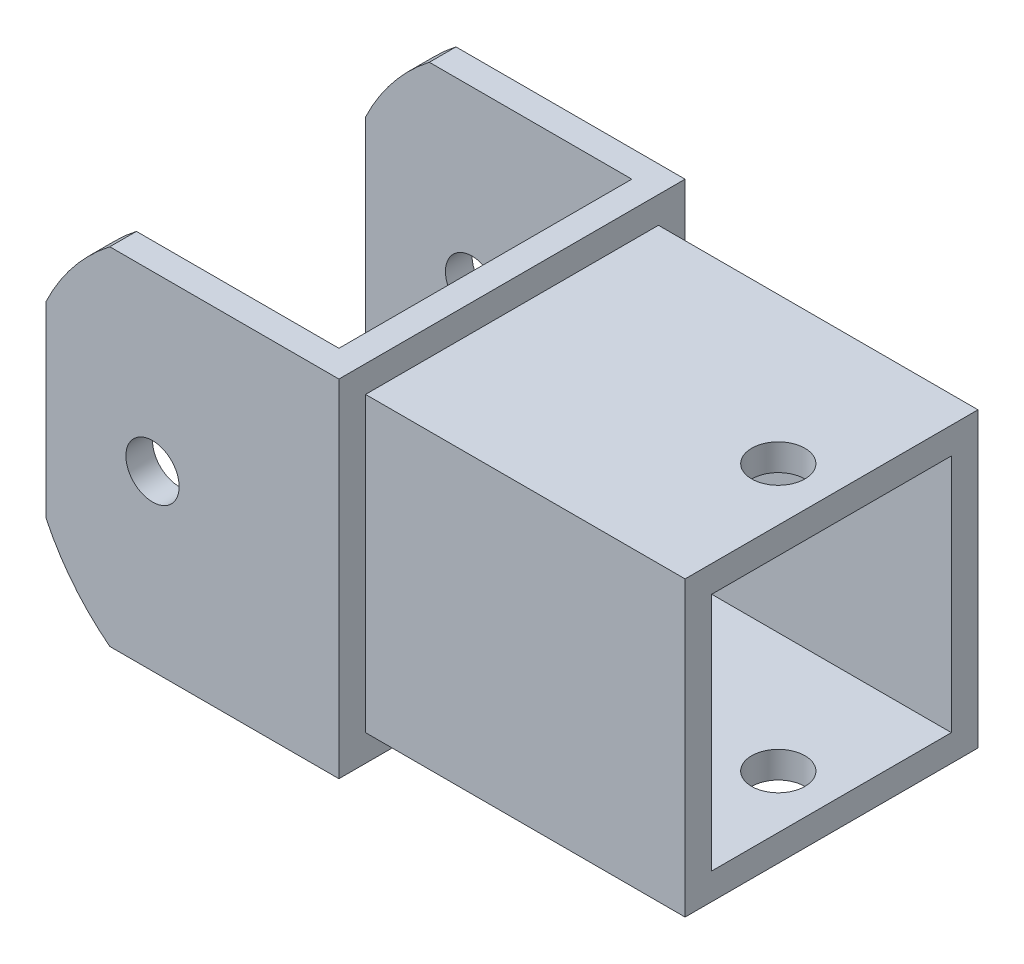
ISO-10303-21;
HEADER;
FILE_DESCRIPTION(('STEP AP214'),'2;1');
FILE_NAME('part.step','',(''),(''),'','','');
FILE_SCHEMA(('AUTOMOTIVE_DESIGN { 1 0 10303 214 1 1 1 1 }'));
ENDSEC;
DATA;
#1=APPLICATION_CONTEXT('core data for automotive mechanical design processes');
#2=APPLICATION_PROTOCOL_DEFINITION('international standard','automotive_design',2000,#1);
#3=PRODUCT_CONTEXT('',#1,'mechanical');
#4=PRODUCT('Part','Part','',(#3));
#5=PRODUCT_RELATED_PRODUCT_CATEGORY('part','',(#4));
#6=PRODUCT_DEFINITION_FORMATION('','',#4);
#7=PRODUCT_DEFINITION_CONTEXT('part definition',#1,'design');
#8=PRODUCT_DEFINITION('design','',#6,#7);
#9=PRODUCT_DEFINITION_SHAPE('','',#8);
#10=(LENGTH_UNIT() NAMED_UNIT(*) SI_UNIT(.MILLI.,.METRE.));
#11=(NAMED_UNIT(*) PLANE_ANGLE_UNIT() SI_UNIT($,.RADIAN.));
#12=(NAMED_UNIT(*) SI_UNIT($,.STERADIAN.) SOLID_ANGLE_UNIT());
#13=UNCERTAINTY_MEASURE_WITH_UNIT(LENGTH_MEASURE(1.E-05),#10,'distance_accuracy_value','');
#14=(GEOMETRIC_REPRESENTATION_CONTEXT(3) GLOBAL_UNCERTAINTY_ASSIGNED_CONTEXT((#13)) GLOBAL_UNIT_ASSIGNED_CONTEXT((#10,
#11,#12)) REPRESENTATION_CONTEXT('',''));
#15=CARTESIAN_POINT('',(0.,0.,0.));
#16=DIRECTION('',(0.,0.,1.));
#17=DIRECTION('',(1.,0.,0.));
#18=AXIS2_PLACEMENT_3D('',#15,#16,#17);
#19=CARTESIAN_POINT('',(-50.8,82.5500000000003,-50.8000000000003));
#20=DIRECTION('',(1.,0.,0.));
#21=DIRECTION('',(0.,0.,-1.));
#22=AXIS2_PLACEMENT_3D('',#19,#20,#21);
#23=PLANE('',#22);
#24=DIRECTION('',(0.,0.,1.));
#25=VECTOR('',#24,1.);
#26=CARTESIAN_POINT('',(-50.8,44.7045580116448,-50.8000000000001));
#27=LINE('',#26,#25);
#28=CARTESIAN_POINT('',(-50.8,44.7045580116448,-50.8000000000003));
#29=VERTEX_POINT('',#28);
#30=CARTESIAN_POINT('',(-50.8,44.7045580116449,-38.1000000000003));
#31=VERTEX_POINT('',#30);
#32=EDGE_CURVE('E239',#29,#31,#27,.T.);
#33=ORIENTED_EDGE('',*,*,#32,.F.);
#34=DIRECTION('',(0.,-1.,0.));
#35=VECTOR('',#34,1.);
#36=CARTESIAN_POINT('',(-50.8,82.5500000000003,-50.8000000000003));
#37=LINE('',#36,#35);
#38=CARTESIAN_POINT('',(-50.8,-44.7045580116442,-50.8000000000003));
#39=VERTEX_POINT('',#38);
#40=EDGE_CURVE('E197',#29,#39,#37,.T.);
#41=ORIENTED_EDGE('',*,*,#40,.T.);
#42=DIRECTION('',(0.,0.,1.));
#43=VECTOR('',#42,1.);
#44=CARTESIAN_POINT('',(-50.8,-44.7045580116442,-50.8000000000001));
#45=LINE('',#44,#43);
#46=CARTESIAN_POINT('',(-50.8,-44.7045580116442,-38.1000000000003));
#47=VERTEX_POINT('',#46);
#48=EDGE_CURVE('E313',#47,#39,#45,.F.);
#49=ORIENTED_EDGE('',*,*,#48,.F.);
#50=DIRECTION('',(0.,-1.,0.));
#51=VECTOR('',#50,1.);
#52=CARTESIAN_POINT('',(-50.8,82.5500000000003,-38.1000000000003));
#53=LINE('',#52,#51);
#54=EDGE_CURVE('E51',#31,#47,#53,.T.);
#55=ORIENTED_EDGE('',*,*,#54,.F.);
#56=EDGE_LOOP('',(#33,#41,#49,#55));
#57=FACE_BOUND('',#56,.T.);
#58=ADVANCED_FACE('F41',(#57),#23,.F.);
#59=CARTESIAN_POINT('',(-50.8,82.5500000000003,-38.1000000000003));
#60=DIRECTION('',(0.,0.,-1.));
#61=DIRECTION('',(-1.,0.,0.));
#62=AXIS2_PLACEMENT_3D('',#59,#60,#61);
#63=PLANE('',#62);
#64=CARTESIAN_POINT('',(0.,3.12250225675825E-13,-38.1000000000003));
#65=DIRECTION('',(0.,0.,-1.));
#66=DIRECTION('',(-1.,0.,0.));
#67=AXIS2_PLACEMENT_3D('',#64,#65,#66);
#68=CIRCLE('',#67,12.7);
#69=CARTESIAN_POINT('',(-12.7,3.12250225675825E-13,-38.1000000000003));
#70=VERTEX_POINT('',#69);
#71=EDGE_CURVE('E341',#70,#70,#68,.T.);
#72=ORIENTED_EDGE('',*,*,#71,.T.);
#73=EDGE_LOOP('',(#72));
#74=FACE_BOUND('',#73,.T.);
#75=CARTESIAN_POINT('',(43.5564957867523,3.12250225675825E-13,-38.1000000000003));
#76=DIRECTION('',(0.,0.,-1.));
#77=DIRECTION('',(-1.,0.,0.));
#78=AXIS2_PLACEMENT_3D('',#75,#76,#77);
#79=CIRCLE('',#78,104.410946764082);
#80=CARTESIAN_POINT('',(-20.3742738329848,82.5500000000003,-38.1000000000003));
#81=VERTEX_POINT('',#80);
#82=EDGE_CURVE('E67',#31,#81,#79,.T.);
#83=ORIENTED_EDGE('',*,*,#82,.F.);
#84=ORIENTED_EDGE('',*,*,#54,.T.);
#85=CARTESIAN_POINT('',(-20.3742738329847,-82.5499999999997,-38.1000000000003));
#86=VERTEX_POINT('',#85);
#87=EDGE_CURVE('E310',#86,#47,#79,.T.);
#88=ORIENTED_EDGE('',*,*,#87,.F.);
#89=DIRECTION('',(1.,0.,0.));
#90=VECTOR('',#89,1.);
#91=CARTESIAN_POINT('',(-50.8,-82.5499999999997,-38.1000000000003));
#92=LINE('',#91,#90);
#93=CARTESIAN_POINT('',(76.2,-82.5499999999997,-38.1000000000003));
#94=VERTEX_POINT('',#93);
#95=EDGE_CURVE('E214',#86,#94,#92,.T.);
#96=ORIENTED_EDGE('',*,*,#95,.T.);
#97=DIRECTION('',(0.,-1.,0.));
#98=VECTOR('',#97,1.);
#99=CARTESIAN_POINT('',(76.2,82.5500000000003,-38.1000000000003));
#100=LINE('',#99,#98);
#101=CARTESIAN_POINT('',(76.2,82.5500000000003,-38.1000000000003));
#102=VERTEX_POINT('',#101);
#103=EDGE_CURVE('E243',#102,#94,#100,.T.);
#104=ORIENTED_EDGE('',*,*,#103,.F.);
#105=DIRECTION('',(1.,0.,0.));
#106=VECTOR('',#105,1.);
#107=CARTESIAN_POINT('',(-50.8,82.5500000000003,-38.1000000000003));
#108=LINE('',#107,#106);
#109=EDGE_CURVE('E267',#81,#102,#108,.T.);
#110=ORIENTED_EDGE('',*,*,#109,.F.);
#111=EDGE_LOOP('',(#83,#84,#88,#96,#104,#110));
#112=FACE_BOUND('',#111,.T.);
#113=ADVANCED_FACE('F457',(#74,#112),#63,.F.);
#114=CARTESIAN_POINT('',(76.2,82.5500000000003,101.6));
#115=DIRECTION('',(0.,0.,1.));
#116=DIRECTION('',(1.,0.,0.));
#117=AXIS2_PLACEMENT_3D('',#114,#115,#116);
#118=PLANE('',#117);
#119=CARTESIAN_POINT('',(0.,3.12250225675825E-13,101.6));
#120=DIRECTION('',(0.,0.,1.));
#121=DIRECTION('',(1.,0.,0.));
#122=AXIS2_PLACEMENT_3D('',#119,#120,#121);
#123=CIRCLE('',#122,12.7);
#124=CARTESIAN_POINT('',(12.7,3.12250225675825E-13,101.6));
#125=VERTEX_POINT('',#124);
#126=EDGE_CURVE('E337',#125,#125,#123,.T.);
#127=ORIENTED_EDGE('',*,*,#126,.T.);
#128=EDGE_LOOP('',(#127));
#129=FACE_BOUND('',#128,.T.);
#130=CARTESIAN_POINT('',(43.5564957867523,3.12250225675825E-13,101.6));
#131=DIRECTION('',(0.,0.,1.));
#132=DIRECTION('',(1.,0.,0.));
#133=AXIS2_PLACEMENT_3D('',#130,#131,#132);
#134=CIRCLE('',#133,104.410946764082);
#135=CARTESIAN_POINT('',(-20.3742738329847,82.5500000000003,101.6));
#136=VERTEX_POINT('',#135);
#137=CARTESIAN_POINT('',(-50.7999999999997,44.7045580116454,101.6));
#138=VERTEX_POINT('',#137);
#139=EDGE_CURVE('E309',#136,#138,#134,.T.);
#140=ORIENTED_EDGE('',*,*,#139,.F.);
#141=DIRECTION('',(-1.,0.,0.));
#142=VECTOR('',#141,1.);
#143=CARTESIAN_POINT('',(76.2,82.5500000000003,101.6));
#144=LINE('',#143,#142);
#145=CARTESIAN_POINT('',(76.2,82.5500000000003,101.6));
#146=VERTEX_POINT('',#145);
#147=EDGE_CURVE('E433',#146,#136,#144,.T.);
#148=ORIENTED_EDGE('',*,*,#147,.F.);
#149=DIRECTION('',(0.,-1.,0.));
#150=VECTOR('',#149,1.);
#151=CARTESIAN_POINT('',(76.2,82.5500000000003,101.6));
#152=LINE('',#151,#150);
#153=CARTESIAN_POINT('',(76.2,-82.5499999999997,101.6));
#154=VERTEX_POINT('',#153);
#155=EDGE_CURVE('E247',#146,#154,#152,.T.);
#156=ORIENTED_EDGE('',*,*,#155,.T.);
#157=DIRECTION('',(-1.,0.,0.));
#158=VECTOR('',#157,1.);
#159=CARTESIAN_POINT('',(76.2,-82.5499999999997,101.6));
#160=LINE('',#159,#158);
#161=CARTESIAN_POINT('',(-20.3742738329848,-82.5499999999997,101.6));
#162=VERTEX_POINT('',#161);
#163=EDGE_CURVE('E221',#154,#162,#160,.T.);
#164=ORIENTED_EDGE('',*,*,#163,.T.);
#165=CARTESIAN_POINT('',(-50.7999999999997,-44.7045580116448,101.6));
#166=VERTEX_POINT('',#165);
#167=EDGE_CURVE('E306',#166,#162,#134,.T.);
#168=ORIENTED_EDGE('',*,*,#167,.F.);
#169=DIRECTION('',(0.,-1.,0.));
#170=VECTOR('',#169,1.);
#171=CARTESIAN_POINT('',(-50.8,82.5500000000003,101.6));
#172=LINE('',#171,#170);
#173=EDGE_CURVE('E251',#138,#166,#172,.T.);
#174=ORIENTED_EDGE('',*,*,#173,.F.);
#175=EDGE_LOOP('',(#140,#148,#156,#164,#168,#174));
#176=FACE_BOUND('',#175,.T.);
#177=ADVANCED_FACE('F449',(#129,#176),#118,.F.);
#178=CARTESIAN_POINT('',(-50.8,82.5500000000003,101.6));
#179=DIRECTION('',(1.,0.,0.));
#180=DIRECTION('',(0.,0.,-1.));
#181=AXIS2_PLACEMENT_3D('',#178,#179,#180);
#182=PLANE('',#181);
#183=DIRECTION('',(0.,0.,1.));
#184=VECTOR('',#183,1.);
#185=CARTESIAN_POINT('',(-50.7999999999997,44.7045580116454,-50.8000000000005));
#186=LINE('',#185,#184);
#187=CARTESIAN_POINT('',(-50.8,44.7045580116449,114.3));
#188=VERTEX_POINT('',#187);
#189=EDGE_CURVE('E305',#138,#188,#186,.T.);
#190=ORIENTED_EDGE('',*,*,#189,.F.);
#191=ORIENTED_EDGE('',*,*,#173,.T.);
#192=DIRECTION('',(0.,0.,1.));
#193=VECTOR('',#192,1.);
#194=CARTESIAN_POINT('',(-50.7999999999997,-44.7045580116448,-50.8000000000005));
#195=LINE('',#194,#193);
#196=CARTESIAN_POINT('',(-50.8,-44.7045580116442,114.3));
#197=VERTEX_POINT('',#196);
#198=EDGE_CURVE('E297',#197,#166,#195,.F.);
#199=ORIENTED_EDGE('',*,*,#198,.F.);
#200=DIRECTION('',(0.,-1.,0.));
#201=VECTOR('',#200,1.);
#202=CARTESIAN_POINT('',(-50.8,82.5500000000003,114.3));
#203=LINE('',#202,#201);
#204=EDGE_CURVE('E255',#188,#197,#203,.T.);
#205=ORIENTED_EDGE('',*,*,#204,.F.);
#206=EDGE_LOOP('',(#190,#191,#199,#205));
#207=FACE_BOUND('',#206,.T.);
#208=ADVANCED_FACE('F471',(#207),#182,.F.);
#209=CARTESIAN_POINT('',(-50.8,82.5500000000003,114.3));
#210=DIRECTION('',(0.,0.,-1.));
#211=DIRECTION('',(-1.,0.,0.));
#212=AXIS2_PLACEMENT_3D('',#209,#210,#211);
#213=PLANE('',#212);
#214=CARTESIAN_POINT('',(0.,3.12250225675825E-13,114.3));
#215=DIRECTION('',(0.,0.,-1.));
#216=DIRECTION('',(-1.,0.,0.));
#217=AXIS2_PLACEMENT_3D('',#214,#215,#216);
#218=CIRCLE('',#217,12.7);
#219=CARTESIAN_POINT('',(-12.7,3.12250225675825E-13,114.3));
#220=VERTEX_POINT('',#219);
#221=EDGE_CURVE('E333',#220,#220,#218,.T.);
#222=ORIENTED_EDGE('',*,*,#221,.T.);
#223=EDGE_LOOP('',(#222));
#224=FACE_BOUND('',#223,.T.);
#225=CARTESIAN_POINT('',(43.5564957867523,3.12250225675825E-13,114.3));
#226=DIRECTION('',(0.,0.,-1.));
#227=DIRECTION('',(-1.,0.,0.));
#228=AXIS2_PLACEMENT_3D('',#225,#226,#227);
#229=CIRCLE('',#228,104.410946764082);
#230=CARTESIAN_POINT('',(-20.3742738329848,82.5500000000003,114.3));
#231=VERTEX_POINT('',#230);
#232=EDGE_CURVE('E59',#188,#231,#229,.T.);
#233=ORIENTED_EDGE('',*,*,#232,.F.);
#234=ORIENTED_EDGE('',*,*,#204,.T.);
#235=CARTESIAN_POINT('',(-20.3742738329847,-82.5499999999997,114.3));
#236=VERTEX_POINT('',#235);
#237=EDGE_CURVE('E186',#236,#197,#229,.T.);
#238=ORIENTED_EDGE('',*,*,#237,.F.);
#239=DIRECTION('',(1.,0.,0.));
#240=VECTOR('',#239,1.);
#241=CARTESIAN_POINT('',(-50.8,-82.5499999999997,114.3));
#242=LINE('',#241,#240);
#243=CARTESIAN_POINT('',(88.9000000000001,-82.5499999999997,114.3));
#244=VERTEX_POINT('',#243);
#245=EDGE_CURVE('E225',#236,#244,#242,.T.);
#246=ORIENTED_EDGE('',*,*,#245,.T.);
#247=DIRECTION('',(0.,-1.,0.));
#248=VECTOR('',#247,1.);
#249=CARTESIAN_POINT('',(88.9000000000001,82.5500000000003,114.3));
#250=LINE('',#249,#248);
#251=CARTESIAN_POINT('',(88.9000000000001,82.5500000000003,114.3));
#252=VERTEX_POINT('',#251);
#253=EDGE_CURVE('E259',#252,#244,#250,.T.);
#254=ORIENTED_EDGE('',*,*,#253,.F.);
#255=DIRECTION('',(1.,0.,0.));
#256=VECTOR('',#255,1.);
#257=CARTESIAN_POINT('',(-50.8,82.5500000000003,114.3));
#258=LINE('',#257,#256);
#259=EDGE_CURVE('E44',#231,#252,#258,.T.);
#260=ORIENTED_EDGE('',*,*,#259,.F.);
#261=EDGE_LOOP('',(#233,#234,#238,#246,#254,#260));
#262=FACE_BOUND('',#261,.T.);
#263=ADVANCED_FACE('F441',(#224,#262),#213,.F.);
#264=CARTESIAN_POINT('',(88.9,82.5500000000003,-50.8000000000003));
#265=DIRECTION('',(0.,0.,1.));
#266=DIRECTION('',(1.,0.,0.));
#267=AXIS2_PLACEMENT_3D('',#264,#265,#266);
#268=PLANE('',#267);
#269=CARTESIAN_POINT('',(0.,3.12250225675825E-13,-50.8000000000003));
#270=DIRECTION('',(0.,0.,1.));
#271=DIRECTION('',(1.,0.,0.));
#272=AXIS2_PLACEMENT_3D('',#269,#270,#271);
#273=CIRCLE('',#272,12.7);
#274=CARTESIAN_POINT('',(12.7,3.12250225675825E-13,-50.8000000000003));
#275=VERTEX_POINT('',#274);
#276=EDGE_CURVE('E329',#275,#275,#273,.T.);
#277=ORIENTED_EDGE('',*,*,#276,.T.);
#278=EDGE_LOOP('',(#277));
#279=FACE_BOUND('',#278,.T.);
#280=CARTESIAN_POINT('',(43.5564957867523,3.12250225675825E-13,-50.8000000000003));
#281=DIRECTION('',(0.,0.,1.));
#282=DIRECTION('',(1.,0.,0.));
#283=AXIS2_PLACEMENT_3D('',#280,#281,#282);
#284=CIRCLE('',#283,104.410946764082);
#285=CARTESIAN_POINT('',(-20.3742738329847,82.5500000000003,-50.8000000000003));
#286=VERTEX_POINT('',#285);
#287=EDGE_CURVE('E180',#286,#29,#284,.T.);
#288=ORIENTED_EDGE('',*,*,#287,.F.);
#289=DIRECTION('',(-1.,0.,0.));
#290=VECTOR('',#289,1.);
#291=CARTESIAN_POINT('',(88.9,82.5500000000003,-50.8000000000003));
#292=LINE('',#291,#290);
#293=CARTESIAN_POINT('',(88.9,82.5500000000003,-50.8000000000003));
#294=VERTEX_POINT('',#293);
#295=EDGE_CURVE('E194',#294,#286,#292,.T.);
#296=ORIENTED_EDGE('',*,*,#295,.F.);
#297=DIRECTION('',(0.,-1.,0.));
#298=VECTOR('',#297,1.);
#299=CARTESIAN_POINT('',(88.9,82.5500000000003,-50.8000000000003));
#300=LINE('',#299,#298);
#301=CARTESIAN_POINT('',(88.9,-82.5499999999997,-50.8000000000003));
#302=VERTEX_POINT('',#301);
#303=EDGE_CURVE('E210',#294,#302,#300,.T.);
#304=ORIENTED_EDGE('',*,*,#303,.T.);
#305=DIRECTION('',(-1.,0.,0.));
#306=VECTOR('',#305,1.);
#307=CARTESIAN_POINT('',(88.9,-82.5499999999997,-50.8000000000003));
#308=LINE('',#307,#306);
#309=CARTESIAN_POINT('',(-20.3742738329847,-82.5499999999997,-50.8000000000003));
#310=VERTEX_POINT('',#309);
#311=EDGE_CURVE('E264',#302,#310,#308,.T.);
#312=ORIENTED_EDGE('',*,*,#311,.T.);
#313=EDGE_CURVE('E200',#39,#310,#284,.T.);
#314=ORIENTED_EDGE('',*,*,#313,.F.);
#315=ORIENTED_EDGE('',*,*,#40,.F.);
#316=EDGE_LOOP('',(#288,#296,#304,#312,#314,#315));
#317=FACE_BOUND('',#316,.T.);
#318=ADVANCED_FACE('F192',(#279,#317),#268,.F.);
#319=CARTESIAN_POINT('',(0.,82.5500000000003,-2.70616862252382E-13));
#320=DIRECTION('',(0.,1.,0.));
#321=DIRECTION('',(0.,0.,1.));
#322=AXIS2_PLACEMENT_3D('',#319,#320,#321);
#323=PLANE('',#322);
#324=ORIENTED_EDGE('',*,*,#295,.T.);
#325=DIRECTION('',(0.,0.,1.));
#326=VECTOR('',#325,1.);
#327=CARTESIAN_POINT('',(-20.3742738329847,82.5500000000003,-50.8000000000003));
#328=LINE('',#327,#326);
#329=EDGE_CURVE('E177',#286,#81,#328,.T.);
#330=ORIENTED_EDGE('',*,*,#329,.T.);
#331=ORIENTED_EDGE('',*,*,#109,.T.);
#332=DIRECTION('',(0.,0.,1.));
#333=VECTOR('',#332,1.);
#334=CARTESIAN_POINT('',(76.2,82.5500000000003,-38.1000000000003));
#335=LINE('',#334,#333);
#336=EDGE_CURVE('E271',#102,#146,#335,.T.);
#337=ORIENTED_EDGE('',*,*,#336,.T.);
#338=ORIENTED_EDGE('',*,*,#147,.T.);
#339=EDGE_CURVE('E187',#136,#231,#328,.T.);
#340=ORIENTED_EDGE('',*,*,#339,.T.);
#341=ORIENTED_EDGE('',*,*,#259,.T.);
#342=DIRECTION('',(0.,0.,-1.));
#343=VECTOR('',#342,1.);
#344=CARTESIAN_POINT('',(88.9000000000001,82.5500000000003,114.3));
#345=LINE('',#344,#343);
#346=EDGE_CURVE('E204',#252,#294,#345,.T.);
#347=ORIENTED_EDGE('',*,*,#346,.T.);
#348=EDGE_LOOP('',(#324,#330,#331,#337,#338,#340,#341,#347));
#349=FACE_BOUND('',#348,.T.);
#350=ADVANCED_FACE('F202',(#349),#323,.T.);
#351=CARTESIAN_POINT('',(0.,-82.5499999999997,-2.70616862252382E-13));
#352=DIRECTION('',(0.,1.,0.));
#353=DIRECTION('',(0.,0.,1.));
#354=AXIS2_PLACEMENT_3D('',#351,#352,#353);
#355=PLANE('',#354);
#356=DIRECTION('',(0.,0.,1.));
#357=VECTOR('',#356,1.);
#358=CARTESIAN_POINT('',(-20.3742738329847,-82.5499999999997,-50.8000000000003));
#359=LINE('',#358,#357);
#360=EDGE_CURVE('E199',#310,#86,#359,.T.);
#361=ORIENTED_EDGE('',*,*,#360,.F.);
#362=ORIENTED_EDGE('',*,*,#311,.F.);
#363=DIRECTION('',(0.,0.,-1.));
#364=VECTOR('',#363,1.);
#365=CARTESIAN_POINT('',(88.9000000000001,-82.5499999999997,114.3));
#366=LINE('',#365,#364);
#367=EDGE_CURVE('E228',#244,#302,#366,.T.);
#368=ORIENTED_EDGE('',*,*,#367,.F.);
#369=ORIENTED_EDGE('',*,*,#245,.F.);
#370=DIRECTION('',(0.,0.,1.));
#371=VECTOR('',#370,1.);
#372=CARTESIAN_POINT('',(-20.3742738329848,-82.5499999999997,-50.8000000000003));
#373=LINE('',#372,#371);
#374=EDGE_CURVE('E11',#162,#236,#373,.T.);
#375=ORIENTED_EDGE('',*,*,#374,.F.);
#376=ORIENTED_EDGE('',*,*,#163,.F.);
#377=DIRECTION('',(0.,0.,1.));
#378=VECTOR('',#377,1.);
#379=CARTESIAN_POINT('',(76.2,-82.5499999999997,-38.1000000000003));
#380=LINE('',#379,#378);
#381=EDGE_CURVE('E217',#94,#154,#380,.T.);
#382=ORIENTED_EDGE('',*,*,#381,.F.);
#383=ORIENTED_EDGE('',*,*,#95,.F.);
#384=EDGE_LOOP('',(#361,#362,#368,#369,#375,#376,#382,#383));
#385=FACE_BOUND('',#384,.T.);
#386=ADVANCED_FACE('F281',(#385),#355,.F.);
#387=CARTESIAN_POINT('',(88.9000000000001,82.5500000000003,114.3));
#388=DIRECTION('',(-1.,0.,0.));
#389=DIRECTION('',(0.,0.,1.));
#390=AXIS2_PLACEMENT_3D('',#387,#388,#389);
#391=PLANE('',#390);
#392=ORIENTED_EDGE('',*,*,#367,.T.);
#393=ORIENTED_EDGE('',*,*,#303,.F.);
#394=ORIENTED_EDGE('',*,*,#346,.F.);
#395=ORIENTED_EDGE('',*,*,#253,.T.);
#396=EDGE_LOOP('',(#392,#393,#394,#395));
#397=FACE_BOUND('',#396,.T.);
#398=DIRECTION('',(0.,1.,0.));
#399=VECTOR('',#398,1.);
#400=CARTESIAN_POINT('',(88.9,69.8500000000003,-38.1000000000003));
#401=LINE('',#400,#399);
#402=CARTESIAN_POINT('',(88.9,-69.8499999999996,-38.1000000000003));
#403=VERTEX_POINT('',#402);
#404=CARTESIAN_POINT('',(88.9,69.8500000000003,-38.1000000000003));
#405=VERTEX_POINT('',#404);
#406=EDGE_CURVE('E387',#403,#405,#401,.T.);
#407=ORIENTED_EDGE('',*,*,#406,.F.);
#408=DIRECTION('',(0.,0.,-1.));
#409=VECTOR('',#408,1.);
#410=CARTESIAN_POINT('',(88.9,-69.8499999999997,101.6));
#411=LINE('',#410,#409);
#412=CARTESIAN_POINT('',(88.9000000000001,-69.8499999999997,101.6));
#413=VERTEX_POINT('',#412);
#414=EDGE_CURVE('E393',#413,#403,#411,.T.);
#415=ORIENTED_EDGE('',*,*,#414,.F.);
#416=DIRECTION('',(0.,-1.,0.));
#417=VECTOR('',#416,1.);
#418=CARTESIAN_POINT('',(88.9,69.8500000000003,101.6));
#419=LINE('',#418,#417);
#420=CARTESIAN_POINT('',(88.9000000000001,69.8500000000003,101.6));
#421=VERTEX_POINT('',#420);
#422=EDGE_CURVE('E410',#421,#413,#419,.T.);
#423=ORIENTED_EDGE('',*,*,#422,.F.);
#424=DIRECTION('',(0.,0.,1.));
#425=VECTOR('',#424,1.);
#426=CARTESIAN_POINT('',(88.9,69.8500000000003,101.6));
#427=LINE('',#426,#425);
#428=EDGE_CURVE('E406',#405,#421,#427,.T.);
#429=ORIENTED_EDGE('',*,*,#428,.F.);
#430=EDGE_LOOP('',(#407,#415,#423,#429));
#431=FACE_BOUND('',#430,.T.);
#432=ADVANCED_FACE('F275',(#397,#431),#391,.F.);
#433=CARTESIAN_POINT('',(76.2,82.5500000000003,-38.1000000000003));
#434=DIRECTION('',(1.,0.,0.));
#435=DIRECTION('',(0.,0.,-1.));
#436=AXIS2_PLACEMENT_3D('',#433,#434,#435);
#437=PLANE('',#436);
#438=ORIENTED_EDGE('',*,*,#381,.T.);
#439=ORIENTED_EDGE('',*,*,#155,.F.);
#440=ORIENTED_EDGE('',*,*,#336,.F.);
#441=ORIENTED_EDGE('',*,*,#103,.T.);
#442=EDGE_LOOP('',(#438,#439,#440,#441));
#443=FACE_BOUND('',#442,.T.);
#444=ADVANCED_FACE('F454',(#443),#437,.F.);
#445=CARTESIAN_POINT('',(241.3,3.12250225675825E-13,-2.4980018054066E-13));
#446=DIRECTION('',(1.,0.,0.));
#447=DIRECTION('',(0.,0.,-1.));
#448=AXIS2_PLACEMENT_3D('',#445,#446,#447);
#449=PLANE('',#448);
#450=DIRECTION('',(0.,1.,0.));
#451=VECTOR('',#450,1.);
#452=CARTESIAN_POINT('',(241.3,69.8500000000003,-38.1000000000003));
#453=LINE('',#452,#451);
#454=CARTESIAN_POINT('',(241.3,-69.8499999999996,-38.1000000000003));
#455=VERTEX_POINT('',#454);
#456=CARTESIAN_POINT('',(241.3,69.8500000000003,-38.1000000000003));
#457=VERTEX_POINT('',#456);
#458=EDGE_CURVE('E388',#455,#457,#453,.T.);
#459=ORIENTED_EDGE('',*,*,#458,.T.);
#460=DIRECTION('',(0.,0.,1.));
#461=VECTOR('',#460,1.);
#462=CARTESIAN_POINT('',(241.3,69.8500000000003,101.6));
#463=LINE('',#462,#461);
#464=CARTESIAN_POINT('',(241.3,69.8500000000003,101.6));
#465=VERTEX_POINT('',#464);
#466=EDGE_CURVE('E392',#457,#465,#463,.T.);
#467=ORIENTED_EDGE('',*,*,#466,.T.);
#468=DIRECTION('',(0.,-1.,0.));
#469=VECTOR('',#468,1.);
#470=CARTESIAN_POINT('',(241.3,69.8500000000003,101.6));
#471=LINE('',#470,#469);
#472=CARTESIAN_POINT('',(241.3,-69.8499999999997,101.6));
#473=VERTEX_POINT('',#472);
#474=EDGE_CURVE('E396',#465,#473,#471,.T.);
#475=ORIENTED_EDGE('',*,*,#474,.T.);
#476=DIRECTION('',(0.,0.,-1.));
#477=VECTOR('',#476,1.);
#478=CARTESIAN_POINT('',(241.3,-69.8499999999997,101.6));
#479=LINE('',#478,#477);
#480=EDGE_CURVE('E399',#473,#455,#479,.T.);
#481=ORIENTED_EDGE('',*,*,#480,.T.);
#482=EDGE_LOOP('',(#459,#467,#475,#481));
#483=FACE_BOUND('',#482,.T.);
#484=DIRECTION('',(0.,0.,1.));
#485=VECTOR('',#484,1.);
#486=CARTESIAN_POINT('',(241.3,57.1500000000004,88.8999999999997));
#487=LINE('',#486,#485);
#488=CARTESIAN_POINT('',(241.3,57.1500000000004,-25.4000000000003));
#489=VERTEX_POINT('',#488);
#490=CARTESIAN_POINT('',(241.3,57.1500000000004,88.8999999999997));
#491=VERTEX_POINT('',#490);
#492=EDGE_CURVE('E349',#489,#491,#487,.T.);
#493=ORIENTED_EDGE('',*,*,#492,.F.);
#494=DIRECTION('',(0.,1.,0.));
#495=VECTOR('',#494,1.);
#496=CARTESIAN_POINT('',(241.3,57.1500000000004,-25.4000000000003));
#497=LINE('',#496,#495);
#498=CARTESIAN_POINT('',(241.3,-57.1499999999997,-25.4000000000003));
#499=VERTEX_POINT('',#498);
#500=EDGE_CURVE('E346',#499,#489,#497,.T.);
#501=ORIENTED_EDGE('',*,*,#500,.F.);
#502=DIRECTION('',(0.,0.,-1.));
#503=VECTOR('',#502,1.);
#504=CARTESIAN_POINT('',(241.3,-57.1499999999997,88.8999999999997));
#505=LINE('',#504,#503);
#506=CARTESIAN_POINT('',(241.3,-57.1499999999997,88.8999999999997));
#507=VERTEX_POINT('',#506);
#508=EDGE_CURVE('E357',#507,#499,#505,.T.);
#509=ORIENTED_EDGE('',*,*,#508,.F.);
#510=DIRECTION('',(0.,-1.,0.));
#511=VECTOR('',#510,1.);
#512=CARTESIAN_POINT('',(241.3,57.1500000000004,88.8999999999997));
#513=LINE('',#512,#511);
#514=EDGE_CURVE('E353',#491,#507,#513,.T.);
#515=ORIENTED_EDGE('',*,*,#514,.F.);
#516=EDGE_LOOP('',(#493,#501,#509,#515));
#517=FACE_BOUND('',#516,.T.);
#518=ADVANCED_FACE('F494',(#483,#517),#449,.T.);
#519=CARTESIAN_POINT('',(241.3,69.8500000000003,-38.1000000000003));
#520=DIRECTION('',(0.,0.,1.));
#521=DIRECTION('',(1.,0.,0.));
#522=AXIS2_PLACEMENT_3D('',#519,#520,#521);
#523=PLANE('',#522);
#524=ORIENTED_EDGE('',*,*,#406,.T.);
#525=DIRECTION('',(-1.,0.,0.));
#526=VECTOR('',#525,1.);
#527=CARTESIAN_POINT('',(241.3,69.8500000000003,-38.1000000000003));
#528=LINE('',#527,#526);
#529=EDGE_CURVE('E218',#457,#405,#528,.T.);
#530=ORIENTED_EDGE('',*,*,#529,.F.);
#531=ORIENTED_EDGE('',*,*,#458,.F.);
#532=DIRECTION('',(-1.,0.,0.));
#533=VECTOR('',#532,1.);
#534=CARTESIAN_POINT('',(241.3,-69.8499999999996,-38.1000000000003));
#535=LINE('',#534,#533);
#536=EDGE_CURVE('E402',#455,#403,#535,.T.);
#537=ORIENTED_EDGE('',*,*,#536,.T.);
#538=EDGE_LOOP('',(#524,#530,#531,#537));
#539=FACE_BOUND('',#538,.T.);
#540=ADVANCED_FACE('F514',(#539),#523,.F.);
#541=CARTESIAN_POINT('',(241.3,69.8500000000003,101.6));
#542=DIRECTION('',(0.,-1.,0.));
#543=DIRECTION('',(0.,0.,-1.));
#544=AXIS2_PLACEMENT_3D('',#541,#542,#543);
#545=PLANE('',#544);
#546=CARTESIAN_POINT('',(215.9,69.8500000000003,31.7499999999997));
#547=DIRECTION('',(0.,-1.,0.));
#548=DIRECTION('',(0.,0.,-1.));
#549=AXIS2_PLACEMENT_3D('',#546,#547,#548);
#550=CIRCLE('',#549,12.7);
#551=CARTESIAN_POINT('',(215.9,69.8500000000003,19.0499999999997));
#552=VERTEX_POINT('',#551);
#553=EDGE_CURVE('E325',#552,#552,#550,.T.);
#554=ORIENTED_EDGE('',*,*,#553,.T.);
#555=EDGE_LOOP('',(#554));
#556=FACE_BOUND('',#555,.T.);
#557=ORIENTED_EDGE('',*,*,#428,.T.);
#558=DIRECTION('',(-1.,0.,0.));
#559=VECTOR('',#558,1.);
#560=CARTESIAN_POINT('',(241.3,69.8500000000003,101.6));
#561=LINE('',#560,#559);
#562=EDGE_CURVE('E424',#465,#421,#561,.T.);
#563=ORIENTED_EDGE('',*,*,#562,.F.);
#564=ORIENTED_EDGE('',*,*,#466,.F.);
#565=ORIENTED_EDGE('',*,*,#529,.T.);
#566=EDGE_LOOP('',(#557,#563,#564,#565));
#567=FACE_BOUND('',#566,.T.);
#568=ADVANCED_FACE('F517',(#556,#567),#545,.F.);
#569=CARTESIAN_POINT('',(241.3,69.8500000000003,101.6));
#570=DIRECTION('',(0.,0.,-1.));
#571=DIRECTION('',(-1.,0.,0.));
#572=AXIS2_PLACEMENT_3D('',#569,#570,#571);
#573=PLANE('',#572);
#574=ORIENTED_EDGE('',*,*,#422,.T.);
#575=DIRECTION('',(-1.,0.,0.));
#576=VECTOR('',#575,1.);
#577=CARTESIAN_POINT('',(241.3,-69.8499999999997,101.6));
#578=LINE('',#577,#576);
#579=EDGE_CURVE('E420',#473,#413,#578,.T.);
#580=ORIENTED_EDGE('',*,*,#579,.F.);
#581=ORIENTED_EDGE('',*,*,#474,.F.);
#582=ORIENTED_EDGE('',*,*,#562,.T.);
#583=EDGE_LOOP('',(#574,#580,#581,#582));
#584=FACE_BOUND('',#583,.T.);
#585=ADVANCED_FACE('F521',(#584),#573,.F.);
#586=CARTESIAN_POINT('',(241.3,-69.8499999999997,101.6));
#587=DIRECTION('',(0.,1.,0.));
#588=DIRECTION('',(0.,0.,1.));
#589=AXIS2_PLACEMENT_3D('',#586,#587,#588);
#590=PLANE('',#589);
#591=CARTESIAN_POINT('',(215.9,-69.8499999999996,31.7499999999997));
#592=DIRECTION('',(0.,1.,0.));
#593=DIRECTION('',(0.,0.,1.));
#594=AXIS2_PLACEMENT_3D('',#591,#592,#593);
#595=CIRCLE('',#594,12.7);
#596=CARTESIAN_POINT('',(215.9,-69.8499999999996,44.4499999999998));
#597=VERTEX_POINT('',#596);
#598=EDGE_CURVE('E321',#597,#597,#595,.T.);
#599=ORIENTED_EDGE('',*,*,#598,.T.);
#600=EDGE_LOOP('',(#599));
#601=FACE_BOUND('',#600,.T.);
#602=ORIENTED_EDGE('',*,*,#414,.T.);
#603=ORIENTED_EDGE('',*,*,#536,.F.);
#604=ORIENTED_EDGE('',*,*,#480,.F.);
#605=ORIENTED_EDGE('',*,*,#579,.T.);
#606=EDGE_LOOP('',(#602,#603,#604,#605));
#607=FACE_BOUND('',#606,.T.);
#608=ADVANCED_FACE('F525',(#601,#607),#590,.F.);
#609=CARTESIAN_POINT('',(241.3,57.1500000000004,-25.4000000000003));
#610=DIRECTION('',(0.,0.,1.));
#611=DIRECTION('',(0.,-1.,0.));
#612=AXIS2_PLACEMENT_3D('',#609,#610,#611);
#613=PLANE('',#612);
#614=DIRECTION('',(0.,1.,0.));
#615=VECTOR('',#614,1.);
#616=CARTESIAN_POINT('',(88.9,57.1500000000004,-25.4000000000003));
#617=LINE('',#616,#615);
#618=CARTESIAN_POINT('',(88.9,-57.1499999999997,-25.4000000000003));
#619=VERTEX_POINT('',#618);
#620=CARTESIAN_POINT('',(88.9,57.1500000000004,-25.4000000000003));
#621=VERTEX_POINT('',#620);
#622=EDGE_CURVE('E345',#619,#621,#617,.T.);
#623=ORIENTED_EDGE('',*,*,#622,.F.);
#624=DIRECTION('',(-1.,0.,0.));
#625=VECTOR('',#624,1.);
#626=CARTESIAN_POINT('',(241.3,-57.1499999999997,-25.4000000000003));
#627=LINE('',#626,#625);
#628=EDGE_CURVE('E360',#499,#619,#627,.T.);
#629=ORIENTED_EDGE('',*,*,#628,.F.);
#630=ORIENTED_EDGE('',*,*,#500,.T.);
#631=DIRECTION('',(-1.,0.,0.));
#632=VECTOR('',#631,1.);
#633=CARTESIAN_POINT('',(241.3,57.1500000000004,-25.4000000000003));
#634=LINE('',#633,#632);
#635=EDGE_CURVE('E383',#489,#621,#634,.T.);
#636=ORIENTED_EDGE('',*,*,#635,.T.);
#637=EDGE_LOOP('',(#623,#629,#630,#636));
#638=FACE_BOUND('',#637,.T.);
#639=ADVANCED_FACE('F529',(#638),#613,.T.);
#640=CARTESIAN_POINT('',(241.3,57.1500000000004,88.8999999999997));
#641=DIRECTION('',(0.,-1.,0.));
#642=DIRECTION('',(0.,0.,-1.));
#643=AXIS2_PLACEMENT_3D('',#640,#641,#642);
#644=PLANE('',#643);
#645=CARTESIAN_POINT('',(215.9,57.1500000000003,31.7499999999997));
#646=DIRECTION('',(0.,-1.,0.));
#647=DIRECTION('',(0.,0.,-1.));
#648=AXIS2_PLACEMENT_3D('',#645,#646,#647);
#649=CIRCLE('',#648,12.7);
#650=CARTESIAN_POINT('',(215.9,57.1500000000003,19.0499999999997));
#651=VERTEX_POINT('',#650);
#652=EDGE_CURVE('E238',#651,#651,#649,.T.);
#653=ORIENTED_EDGE('',*,*,#652,.F.);
#654=EDGE_LOOP('',(#653));
#655=FACE_BOUND('',#654,.T.);
#656=DIRECTION('',(0.,0.,1.));
#657=VECTOR('',#656,1.);
#658=CARTESIAN_POINT('',(88.9,57.1500000000004,88.8999999999997));
#659=LINE('',#658,#657);
#660=CARTESIAN_POINT('',(88.9,57.1500000000004,88.8999999999997));
#661=VERTEX_POINT('',#660);
#662=EDGE_CURVE('E364',#621,#661,#659,.T.);
#663=ORIENTED_EDGE('',*,*,#662,.F.);
#664=ORIENTED_EDGE('',*,*,#635,.F.);
#665=ORIENTED_EDGE('',*,*,#492,.T.);
#666=DIRECTION('',(-1.,0.,0.));
#667=VECTOR('',#666,1.);
#668=CARTESIAN_POINT('',(241.3,57.1500000000004,88.8999999999997));
#669=LINE('',#668,#667);
#670=EDGE_CURVE('E380',#491,#661,#669,.T.);
#671=ORIENTED_EDGE('',*,*,#670,.T.);
#672=EDGE_LOOP('',(#663,#664,#665,#671));
#673=FACE_BOUND('',#672,.T.);
#674=ADVANCED_FACE('F536',(#655,#673),#644,.T.);
#675=CARTESIAN_POINT('',(241.3,57.1500000000004,88.8999999999997));
#676=DIRECTION('',(0.,0.,-1.));
#677=DIRECTION('',(0.,1.,0.));
#678=AXIS2_PLACEMENT_3D('',#675,#676,#677);
#679=PLANE('',#678);
#680=DIRECTION('',(0.,-1.,0.));
#681=VECTOR('',#680,1.);
#682=CARTESIAN_POINT('',(88.9,57.1500000000004,88.8999999999997));
#683=LINE('',#682,#681);
#684=CARTESIAN_POINT('',(88.9,-57.1499999999997,88.8999999999997));
#685=VERTEX_POINT('',#684);
#686=EDGE_CURVE('E368',#661,#685,#683,.T.);
#687=ORIENTED_EDGE('',*,*,#686,.F.);
#688=ORIENTED_EDGE('',*,*,#670,.F.);
#689=ORIENTED_EDGE('',*,*,#514,.T.);
#690=DIRECTION('',(-1.,0.,0.));
#691=VECTOR('',#690,1.);
#692=CARTESIAN_POINT('',(241.3,-57.1499999999997,88.8999999999997));
#693=LINE('',#692,#691);
#694=EDGE_CURVE('E377',#507,#685,#693,.T.);
#695=ORIENTED_EDGE('',*,*,#694,.T.);
#696=EDGE_LOOP('',(#687,#688,#689,#695));
#697=FACE_BOUND('',#696,.T.);
#698=ADVANCED_FACE('F540',(#697),#679,.T.);
#699=CARTESIAN_POINT('',(241.3,-57.1499999999997,88.8999999999997));
#700=DIRECTION('',(0.,1.,0.));
#701=DIRECTION('',(0.,0.,1.));
#702=AXIS2_PLACEMENT_3D('',#699,#700,#701);
#703=PLANE('',#702);
#704=CARTESIAN_POINT('',(215.9,-57.1499999999997,31.7499999999997));
#705=DIRECTION('',(0.,1.,0.));
#706=DIRECTION('',(0.,0.,1.));
#707=AXIS2_PLACEMENT_3D('',#704,#705,#706);
#708=CIRCLE('',#707,12.7);
#709=CARTESIAN_POINT('',(215.9,-57.1499999999997,44.4499999999998));
#710=VERTEX_POINT('',#709);
#711=EDGE_CURVE('E233',#710,#710,#708,.T.);
#712=ORIENTED_EDGE('',*,*,#711,.F.);
#713=EDGE_LOOP('',(#712));
#714=FACE_BOUND('',#713,.T.);
#715=DIRECTION('',(0.,0.,-1.));
#716=VECTOR('',#715,1.);
#717=CARTESIAN_POINT('',(88.9,-57.1499999999997,88.8999999999997));
#718=LINE('',#717,#716);
#719=EDGE_CURVE('E350',#685,#619,#718,.T.);
#720=ORIENTED_EDGE('',*,*,#719,.F.);
#721=ORIENTED_EDGE('',*,*,#694,.F.);
#722=ORIENTED_EDGE('',*,*,#508,.T.);
#723=ORIENTED_EDGE('',*,*,#628,.T.);
#724=EDGE_LOOP('',(#720,#721,#722,#723));
#725=FACE_BOUND('',#724,.T.);
#726=ADVANCED_FACE('F505',(#714,#725),#703,.T.);
#727=ORIENTED_EDGE('',*,*,#719,.T.);
#728=ORIENTED_EDGE('',*,*,#622,.T.);
#729=ORIENTED_EDGE('',*,*,#662,.T.);
#730=ORIENTED_EDGE('',*,*,#686,.T.);
#731=EDGE_LOOP('',(#727,#728,#729,#730));
#732=FACE_BOUND('',#731,.T.);
#733=ADVANCED_FACE('F501',(#732),#391,.F.);
#734=CARTESIAN_POINT('',(0.,3.12250225675825E-13,-50.8000000000003));
#735=DIRECTION('',(0.,0.,1.));
#736=DIRECTION('',(1.,0.,0.));
#737=AXIS2_PLACEMENT_3D('',#734,#735,#736);
#738=CYLINDRICAL_SURFACE('',#737,12.7);
#739=ORIENTED_EDGE('',*,*,#276,.F.);
#740=EDGE_LOOP('',(#739));
#741=FACE_BOUND('',#740,.T.);
#742=ORIENTED_EDGE('',*,*,#71,.F.);
#743=EDGE_LOOP('',(#742));
#744=FACE_BOUND('',#743,.T.);
#745=ADVANCED_FACE('F504',(#741,#744),#738,.F.);
#746=ORIENTED_EDGE('',*,*,#221,.F.);
#747=EDGE_LOOP('',(#746));
#748=FACE_BOUND('',#747,.T.);
#749=ORIENTED_EDGE('',*,*,#126,.F.);
#750=EDGE_LOOP('',(#749));
#751=FACE_BOUND('',#750,.T.);
#752=ADVANCED_FACE('F549',(#748,#751),#738,.F.);
#753=CARTESIAN_POINT('',(215.9,-82.5499999999997,31.7499999999997));
#754=DIRECTION('',(0.,1.,0.));
#755=DIRECTION('',(0.,0.,1.));
#756=AXIS2_PLACEMENT_3D('',#753,#754,#755);
#757=CYLINDRICAL_SURFACE('',#756,12.7);
#758=ORIENTED_EDGE('',*,*,#711,.T.);
#759=EDGE_LOOP('',(#758));
#760=FACE_BOUND('',#759,.T.);
#761=ORIENTED_EDGE('',*,*,#598,.F.);
#762=EDGE_LOOP('',(#761));
#763=FACE_BOUND('',#762,.T.);
#764=ADVANCED_FACE('F552',(#760,#763),#757,.F.);
#765=ORIENTED_EDGE('',*,*,#652,.T.);
#766=EDGE_LOOP('',(#765));
#767=FACE_BOUND('',#766,.T.);
#768=ORIENTED_EDGE('',*,*,#553,.F.);
#769=EDGE_LOOP('',(#768));
#770=FACE_BOUND('',#769,.T.);
#771=ADVANCED_FACE('F481',(#767,#770),#757,.F.);
#772=CARTESIAN_POINT('',(43.5564957867523,3.12250225675825E-13,-50.8000000000003));
#773=DIRECTION('',(0.,0.,1.));
#774=DIRECTION('',(1.,0.,0.));
#775=AXIS2_PLACEMENT_3D('',#772,#773,#774);
#776=CYLINDRICAL_SURFACE('',#775,104.410946764082);
#777=ORIENTED_EDGE('',*,*,#167,.T.);
#778=ORIENTED_EDGE('',*,*,#374,.T.);
#779=ORIENTED_EDGE('',*,*,#237,.T.);
#780=ORIENTED_EDGE('',*,*,#198,.T.);
#781=EDGE_LOOP('',(#777,#778,#779,#780));
#782=FACE_BOUND('',#781,.T.);
#783=ADVANCED_FACE('F467',(#782),#776,.T.);
#784=ORIENTED_EDGE('',*,*,#48,.T.);
#785=ORIENTED_EDGE('',*,*,#313,.T.);
#786=ORIENTED_EDGE('',*,*,#360,.T.);
#787=ORIENTED_EDGE('',*,*,#87,.T.);
#788=EDGE_LOOP('',(#784,#785,#786,#787));
#789=FACE_BOUND('',#788,.T.);
#790=ADVANCED_FACE('F460',(#789),#776,.T.);
#791=ORIENTED_EDGE('',*,*,#139,.T.);
#792=ORIENTED_EDGE('',*,*,#189,.T.);
#793=ORIENTED_EDGE('',*,*,#232,.T.);
#794=ORIENTED_EDGE('',*,*,#339,.F.);
#795=EDGE_LOOP('',(#791,#792,#793,#794));
#796=FACE_BOUND('',#795,.T.);
#797=ADVANCED_FACE('F472',(#796),#776,.T.);
#798=ORIENTED_EDGE('',*,*,#32,.T.);
#799=ORIENTED_EDGE('',*,*,#82,.T.);
#800=ORIENTED_EDGE('',*,*,#329,.F.);
#801=ORIENTED_EDGE('',*,*,#287,.T.);
#802=EDGE_LOOP('',(#798,#799,#800,#801));
#803=FACE_BOUND('',#802,.T.);
#804=ADVANCED_FACE('F179',(#803),#776,.T.);
#805=CLOSED_SHELL('',(#58,#113,#177,#208,#263,#318,#350,#386,#432,#444,#518,#540,#568,#585,#608,
#639,#674,#698,#726,#733,#745,#752,#764,#771,#783,#790,#797,#804));
#806=MANIFOLD_SOLID_BREP('B2',#805);
#807=ADVANCED_BREP_SHAPE_REPRESENTATION('',(#18,#806),#14);
#808=SHAPE_DEFINITION_REPRESENTATION(#9,#807);
ENDSEC;
END-ISO-10303-21;
